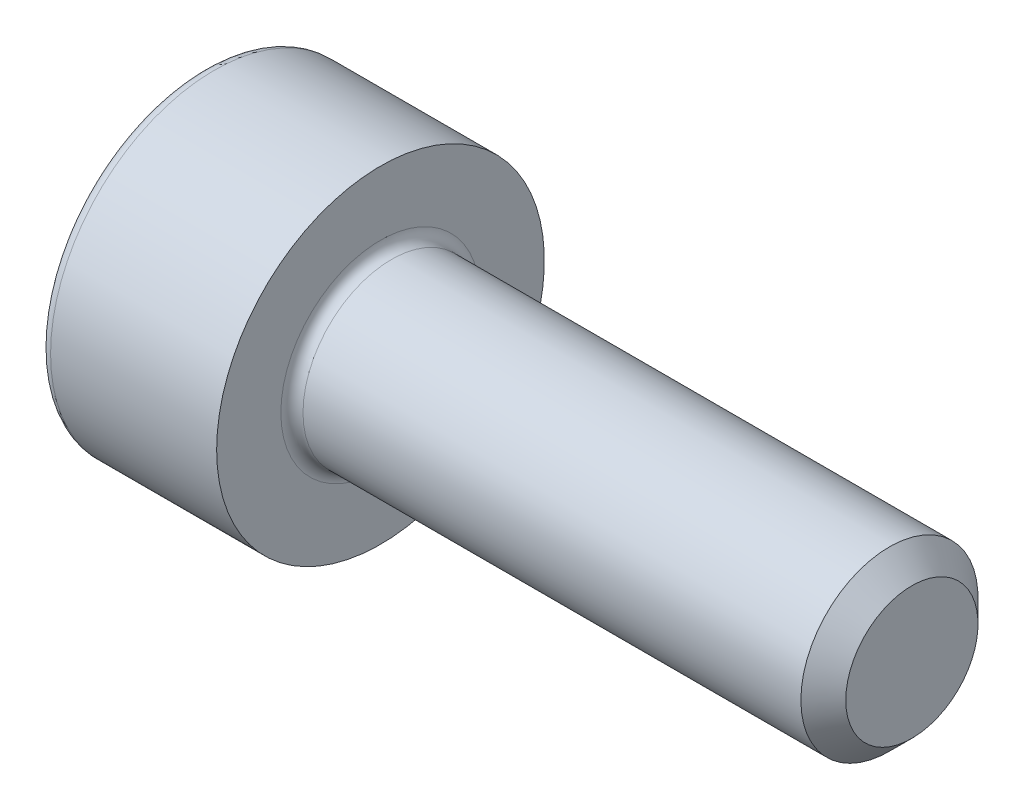
ISO-10303-21;
HEADER;
FILE_DESCRIPTION(('STEP AP214'),'2;1');
FILE_NAME('part.step','',(''),(''),'','','');
FILE_SCHEMA(('AUTOMOTIVE_DESIGN { 1 0 10303 214 1 1 1 1 }'));
ENDSEC;
DATA;
#1=APPLICATION_CONTEXT('core data for automotive mechanical design processes');
#2=APPLICATION_PROTOCOL_DEFINITION('international standard','automotive_design',2000,#1);
#3=PRODUCT_CONTEXT('',#1,'mechanical');
#4=PRODUCT('Part','Part','',(#3));
#5=PRODUCT_RELATED_PRODUCT_CATEGORY('part','',(#4));
#6=PRODUCT_DEFINITION_FORMATION('','',#4);
#7=PRODUCT_DEFINITION_CONTEXT('part definition',#1,'design');
#8=PRODUCT_DEFINITION('design','',#6,#7);
#9=PRODUCT_DEFINITION_SHAPE('','',#8);
#10=(LENGTH_UNIT() NAMED_UNIT(*) SI_UNIT(.MILLI.,.METRE.));
#11=(NAMED_UNIT(*) PLANE_ANGLE_UNIT() SI_UNIT($,.RADIAN.));
#12=(NAMED_UNIT(*) SI_UNIT($,.STERADIAN.) SOLID_ANGLE_UNIT());
#13=UNCERTAINTY_MEASURE_WITH_UNIT(LENGTH_MEASURE(1.E-05),#10,'distance_accuracy_value','');
#14=(GEOMETRIC_REPRESENTATION_CONTEXT(3) GLOBAL_UNCERTAINTY_ASSIGNED_CONTEXT((#13)) GLOBAL_UNIT_ASSIGNED_CONTEXT((#10,
#11,#12)) REPRESENTATION_CONTEXT('',''));
#15=CARTESIAN_POINT('',(0.,0.,0.));
#16=DIRECTION('',(0.,0.,1.));
#17=DIRECTION('',(1.,0.,0.));
#18=AXIS2_PLACEMENT_3D('',#15,#16,#17);
#19=CARTESIAN_POINT('',(6.,0.,0.));
#20=DIRECTION('',(-1.,0.,0.));
#21=DIRECTION('',(0.,0.,1.));
#22=AXIS2_PLACEMENT_3D('',#19,#20,#21);
#23=CONICAL_SURFACE('',#22,0.746499999993503,0.785398163397448);
#24=CARTESIAN_POINT('',(5.7464999999935,0.,0.));
#25=DIRECTION('',(-1.,0.,0.));
#26=DIRECTION('',(0.,0.,1.));
#27=AXIS2_PLACEMENT_3D('',#24,#25,#26);
#28=CIRCLE('',#27,1.);
#29=CARTESIAN_POINT('',(5.7464999999935,0.,1.));
#30=VERTEX_POINT('',#29);
#31=EDGE_CURVE('E11',#30,#30,#28,.T.);
#32=ORIENTED_EDGE('',*,*,#31,.F.);
#33=EDGE_LOOP('',(#32));
#34=FACE_BOUND('',#33,.T.);
#35=CARTESIAN_POINT('',(6.,0.,0.));
#36=DIRECTION('',(-1.,0.,0.));
#37=DIRECTION('',(0.,0.,1.));
#38=AXIS2_PLACEMENT_3D('',#35,#36,#37);
#39=CIRCLE('',#38,0.746499999993503);
#40=CARTESIAN_POINT('',(6.,0.,0.746499999993503));
#41=VERTEX_POINT('',#40);
#42=EDGE_CURVE('E134',#41,#41,#39,.T.);
#43=ORIENTED_EDGE('',*,*,#42,.T.);
#44=EDGE_LOOP('',(#43));
#45=FACE_BOUND('',#44,.T.);
#46=ADVANCED_FACE('F33',(#34,#45),#23,.T.);
#47=CARTESIAN_POINT('',(-2.,0.,0.));
#48=DIRECTION('',(-1.,0.,0.));
#49=DIRECTION('',(0.,0.,1.));
#50=AXIS2_PLACEMENT_3D('',#47,#48,#49);
#51=CYLINDRICAL_SURFACE('',#50,1.);
#52=CARTESIAN_POINT('',(0.125,0.,0.));
#53=DIRECTION('',(-1.,0.,0.));
#54=DIRECTION('',(0.,0.,1.));
#55=AXIS2_PLACEMENT_3D('',#52,#53,#54);
#56=CIRCLE('',#55,1.);
#57=CARTESIAN_POINT('',(0.125,0.,1.));
#58=VERTEX_POINT('',#57);
#59=EDGE_CURVE('E40',#58,#58,#56,.T.);
#60=ORIENTED_EDGE('',*,*,#59,.F.);
#61=EDGE_LOOP('',(#60));
#62=FACE_BOUND('',#61,.T.);
#63=ORIENTED_EDGE('',*,*,#31,.T.);
#64=EDGE_LOOP('',(#63));
#65=FACE_BOUND('',#64,.T.);
#66=ADVANCED_FACE('F158',(#62,#65),#51,.T.);
#67=CARTESIAN_POINT('',(0.125,0.,0.));
#68=DIRECTION('',(-1.,0.,0.));
#69=DIRECTION('',(0.,0.,1.));
#70=AXIS2_PLACEMENT_3D('',#67,#68,#69);
#71=TOROIDAL_SURFACE('',#70,1.125,0.125);
#72=CARTESIAN_POINT('',(0.,0.,0.));
#73=DIRECTION('',(-1.,0.,0.));
#74=DIRECTION('',(0.,0.,1.));
#75=AXIS2_PLACEMENT_3D('',#72,#73,#74);
#76=CIRCLE('',#75,1.125);
#77=CARTESIAN_POINT('',(0.,0.,1.125));
#78=VERTEX_POINT('',#77);
#79=EDGE_CURVE('E151',#78,#78,#76,.T.);
#80=ORIENTED_EDGE('',*,*,#79,.F.);
#81=EDGE_LOOP('',(#80));
#82=FACE_BOUND('',#81,.T.);
#83=ORIENTED_EDGE('',*,*,#59,.T.);
#84=EDGE_LOOP('',(#83));
#85=FACE_BOUND('',#84,.T.);
#86=ADVANCED_FACE('F156',(#82,#85),#71,.F.);
#87=CARTESIAN_POINT('',(0.,1.125,0.));
#88=DIRECTION('',(-1.,0.,0.));
#89=DIRECTION('',(0.,0.,1.));
#90=AXIS2_PLACEMENT_3D('',#87,#88,#89);
#91=PLANE('',#90);
#92=CARTESIAN_POINT('',(0.,0.,0.));
#93=DIRECTION('',(-1.,0.,0.));
#94=DIRECTION('',(0.,0.,1.));
#95=AXIS2_PLACEMENT_3D('',#92,#93,#94);
#96=CIRCLE('',#95,1.85);
#97=CARTESIAN_POINT('',(0.,0.,1.85));
#98=VERTEX_POINT('',#97);
#99=EDGE_CURVE('E148',#98,#98,#96,.T.);
#100=ORIENTED_EDGE('',*,*,#99,.F.);
#101=EDGE_LOOP('',(#100));
#102=FACE_BOUND('',#101,.T.);
#103=ORIENTED_EDGE('',*,*,#79,.T.);
#104=EDGE_LOOP('',(#103));
#105=FACE_BOUND('',#104,.T.);
#106=ADVANCED_FACE('F189',(#102,#105),#91,.F.);
#107=CARTESIAN_POINT('',(-2.,0.,0.));
#108=DIRECTION('',(-1.,0.,0.));
#109=DIRECTION('',(0.,0.,1.));
#110=AXIS2_PLACEMENT_3D('',#107,#108,#109);
#111=CYLINDRICAL_SURFACE('',#110,1.85);
#112=CARTESIAN_POINT('',(-1.875,0.,0.));
#113=DIRECTION('',(-1.,0.,0.));
#114=DIRECTION('',(0.,0.,1.));
#115=AXIS2_PLACEMENT_3D('',#112,#113,#114);
#116=CIRCLE('',#115,1.85);
#117=CARTESIAN_POINT('',(-1.875,0.,1.85));
#118=VERTEX_POINT('',#117);
#119=EDGE_CURVE('E145',#118,#118,#116,.T.);
#120=ORIENTED_EDGE('',*,*,#119,.F.);
#121=EDGE_LOOP('',(#120));
#122=FACE_BOUND('',#121,.T.);
#123=ORIENTED_EDGE('',*,*,#99,.T.);
#124=EDGE_LOOP('',(#123));
#125=FACE_BOUND('',#124,.T.);
#126=ADVANCED_FACE('F185',(#122,#125),#111,.T.);
#127=CARTESIAN_POINT('',(-1.875,0.,0.));
#128=DIRECTION('',(-1.,0.,0.));
#129=DIRECTION('',(0.,0.,1.));
#130=AXIS2_PLACEMENT_3D('',#127,#128,#129);
#131=TOROIDAL_SURFACE('',#130,1.725,0.125);
#132=CARTESIAN_POINT('',(-2.,0.,0.));
#133=DIRECTION('',(-1.,0.,0.));
#134=DIRECTION('',(0.,0.,1.));
#135=AXIS2_PLACEMENT_3D('',#132,#133,#134);
#136=CIRCLE('',#135,1.725);
#137=CARTESIAN_POINT('',(-2.,0.,1.725));
#138=VERTEX_POINT('',#137);
#139=EDGE_CURVE('E142',#138,#138,#136,.T.);
#140=ORIENTED_EDGE('',*,*,#139,.F.);
#141=EDGE_LOOP('',(#140));
#142=FACE_BOUND('',#141,.T.);
#143=ORIENTED_EDGE('',*,*,#119,.T.);
#144=EDGE_LOOP('',(#143));
#145=FACE_BOUND('',#144,.T.);
#146=ADVANCED_FACE('F178',(#142,#145),#131,.T.);
#147=CARTESIAN_POINT('',(-2.,1.725,0.));
#148=DIRECTION('',(1.,0.,0.));
#149=DIRECTION('',(0.,0.,-1.));
#150=AXIS2_PLACEMENT_3D('',#147,#148,#149);
#151=PLANE('',#150);
#152=DIRECTION('',(0.,0.5,-0.866025403784438));
#153=VECTOR('',#152,1.);
#154=CARTESIAN_POINT('',(-2.,0.433012701892219,0.75));
#155=LINE('',#154,#153);
#156=CARTESIAN_POINT('',(-2.,0.433012701892219,0.75));
#157=VERTEX_POINT('',#156);
#158=CARTESIAN_POINT('',(-2.,0.866025403784439,0.));
#159=VERTEX_POINT('',#158);
#160=EDGE_CURVE('E121',#157,#159,#155,.T.);
#161=ORIENTED_EDGE('',*,*,#160,.F.);
#162=DIRECTION('',(0.,1.,0.));
#163=VECTOR('',#162,1.);
#164=CARTESIAN_POINT('',(-2.,-0.43301270189222,0.75));
#165=LINE('',#164,#163);
#166=CARTESIAN_POINT('',(-2.,-0.43301270189222,0.75));
#167=VERTEX_POINT('',#166);
#168=EDGE_CURVE('E47',#167,#157,#165,.T.);
#169=ORIENTED_EDGE('',*,*,#168,.F.);
#170=DIRECTION('',(0.,0.5,0.866025403784439));
#171=VECTOR('',#170,1.);
#172=CARTESIAN_POINT('',(-2.,-0.866025403784439,0.));
#173=LINE('',#172,#171);
#174=CARTESIAN_POINT('',(-2.,-0.866025403784439,0.));
#175=VERTEX_POINT('',#174);
#176=EDGE_CURVE('E130',#175,#167,#173,.T.);
#177=ORIENTED_EDGE('',*,*,#176,.F.);
#178=DIRECTION('',(0.,-0.5,0.866025403784439));
#179=VECTOR('',#178,1.);
#180=CARTESIAN_POINT('',(-2.,-0.433012701892219,-0.75));
#181=LINE('',#180,#179);
#182=CARTESIAN_POINT('',(-2.,-0.433012701892219,-0.75));
#183=VERTEX_POINT('',#182);
#184=EDGE_CURVE('E128',#183,#175,#181,.T.);
#185=ORIENTED_EDGE('',*,*,#184,.F.);
#186=DIRECTION('',(0.,-1.,0.));
#187=VECTOR('',#186,1.);
#188=CARTESIAN_POINT('',(-2.,0.43301270189222,-0.75));
#189=LINE('',#188,#187);
#190=CARTESIAN_POINT('',(-2.,0.43301270189222,-0.75));
#191=VERTEX_POINT('',#190);
#192=EDGE_CURVE('E95',#191,#183,#189,.T.);
#193=ORIENTED_EDGE('',*,*,#192,.F.);
#194=DIRECTION('',(0.,-0.5,-0.866025403784439));
#195=VECTOR('',#194,1.);
#196=CARTESIAN_POINT('',(-2.,0.866025403784439,0.));
#197=LINE('',#196,#195);
#198=EDGE_CURVE('E124',#159,#191,#197,.T.);
#199=ORIENTED_EDGE('',*,*,#198,.F.);
#200=EDGE_LOOP('',(#161,#169,#177,#185,#193,#199));
#201=FACE_BOUND('',#200,.T.);
#202=ORIENTED_EDGE('',*,*,#139,.T.);
#203=EDGE_LOOP('',(#202));
#204=FACE_BOUND('',#203,.T.);
#205=ADVANCED_FACE('F170',(#201,#204),#151,.F.);
#206=CARTESIAN_POINT('',(6.,0.746499999993503,0.));
#207=DIRECTION('',(-1.,0.,0.));
#208=DIRECTION('',(0.,0.,1.));
#209=AXIS2_PLACEMENT_3D('',#206,#207,#208);
#210=PLANE('',#209);
#211=ORIENTED_EDGE('',*,*,#42,.F.);
#212=EDGE_LOOP('',(#211));
#213=FACE_BOUND('',#212,.T.);
#214=ADVANCED_FACE('F167',(#213),#210,.F.);
#215=CARTESIAN_POINT('',(-0.9,-0.43301270189222,0.75));
#216=DIRECTION('',(0.,0.,1.));
#217=DIRECTION('',(1.,0.,0.));
#218=AXIS2_PLACEMENT_3D('',#215,#216,#217);
#219=PLANE('',#218);
#220=ORIENTED_EDGE('',*,*,#168,.T.);
#221=DIRECTION('',(-1.,0.,0.));
#222=VECTOR('',#221,1.);
#223=CARTESIAN_POINT('',(-0.9,0.433012701892219,0.75));
#224=LINE('',#223,#222);
#225=CARTESIAN_POINT('',(-0.9,0.433012701892219,0.75));
#226=VERTEX_POINT('',#225);
#227=EDGE_CURVE('E77',#226,#157,#224,.T.);
#228=ORIENTED_EDGE('',*,*,#227,.F.);
#229=DIRECTION('',(0.,1.,0.));
#230=VECTOR('',#229,1.);
#231=CARTESIAN_POINT('',(-0.9,-0.43301270189222,0.75));
#232=LINE('',#231,#230);
#233=CARTESIAN_POINT('',(-0.9,-0.43301270189222,0.75));
#234=VERTEX_POINT('',#233);
#235=EDGE_CURVE('E132',#234,#226,#232,.T.);
#236=ORIENTED_EDGE('',*,*,#235,.F.);
#237=DIRECTION('',(-1.,0.,0.));
#238=VECTOR('',#237,1.);
#239=CARTESIAN_POINT('',(-0.9,-0.43301270189222,0.75));
#240=LINE('',#239,#238);
#241=EDGE_CURVE('E55',#234,#167,#240,.T.);
#242=ORIENTED_EDGE('',*,*,#241,.T.);
#243=EDGE_LOOP('',(#220,#228,#236,#242));
#244=FACE_BOUND('',#243,.T.);
#245=ADVANCED_FACE('F169',(#244),#219,.F.);
#246=CARTESIAN_POINT('',(-0.9,-0.866025403784439,0.));
#247=DIRECTION('',(0.,-0.866025403784439,0.5));
#248=DIRECTION('',(0.,-0.5,-0.866025403784439));
#249=AXIS2_PLACEMENT_3D('',#246,#247,#248);
#250=PLANE('',#249);
#251=ORIENTED_EDGE('',*,*,#176,.T.);
#252=ORIENTED_EDGE('',*,*,#241,.F.);
#253=DIRECTION('',(0.,0.5,0.866025403784439));
#254=VECTOR('',#253,1.);
#255=CARTESIAN_POINT('',(-0.9,-0.866025403784439,0.));
#256=LINE('',#255,#254);
#257=CARTESIAN_POINT('',(-0.9,-0.866025403784439,0.));
#258=VERTEX_POINT('',#257);
#259=EDGE_CURVE('E107',#258,#234,#256,.T.);
#260=ORIENTED_EDGE('',*,*,#259,.F.);
#261=DIRECTION('',(-1.,0.,0.));
#262=VECTOR('',#261,1.);
#263=CARTESIAN_POINT('',(-0.9,-0.866025403784439,0.));
#264=LINE('',#263,#262);
#265=EDGE_CURVE('E99',#258,#175,#264,.T.);
#266=ORIENTED_EDGE('',*,*,#265,.T.);
#267=EDGE_LOOP('',(#251,#252,#260,#266));
#268=FACE_BOUND('',#267,.T.);
#269=ADVANCED_FACE('F176',(#268),#250,.F.);
#270=CARTESIAN_POINT('',(-0.9,-0.433012701892219,-0.75));
#271=DIRECTION('',(0.,-0.866025403784439,-0.5));
#272=DIRECTION('',(0.,0.5,-0.866025403784439));
#273=AXIS2_PLACEMENT_3D('',#270,#271,#272);
#274=PLANE('',#273);
#275=ORIENTED_EDGE('',*,*,#184,.T.);
#276=ORIENTED_EDGE('',*,*,#265,.F.);
#277=DIRECTION('',(0.,-0.5,0.866025403784439));
#278=VECTOR('',#277,1.);
#279=CARTESIAN_POINT('',(-0.9,-0.433012701892219,-0.75));
#280=LINE('',#279,#278);
#281=CARTESIAN_POINT('',(-0.9,-0.433012701892219,-0.75));
#282=VERTEX_POINT('',#281);
#283=EDGE_CURVE('E103',#282,#258,#280,.T.);
#284=ORIENTED_EDGE('',*,*,#283,.F.);
#285=DIRECTION('',(-1.,0.,0.));
#286=VECTOR('',#285,1.);
#287=CARTESIAN_POINT('',(-0.9,-0.433012701892219,-0.75));
#288=LINE('',#287,#286);
#289=EDGE_CURVE('E88',#282,#183,#288,.T.);
#290=ORIENTED_EDGE('',*,*,#289,.T.);
#291=EDGE_LOOP('',(#275,#276,#284,#290));
#292=FACE_BOUND('',#291,.T.);
#293=ADVANCED_FACE('F104',(#292),#274,.F.);
#294=CARTESIAN_POINT('',(-0.9,0.43301270189222,-0.75));
#295=DIRECTION('',(0.,0.,-1.));
#296=DIRECTION('',(0.,1.,0.));
#297=AXIS2_PLACEMENT_3D('',#294,#295,#296);
#298=PLANE('',#297);
#299=ORIENTED_EDGE('',*,*,#192,.T.);
#300=ORIENTED_EDGE('',*,*,#289,.F.);
#301=DIRECTION('',(0.,-1.,0.));
#302=VECTOR('',#301,1.);
#303=CARTESIAN_POINT('',(-0.9,0.43301270189222,-0.75));
#304=LINE('',#303,#302);
#305=CARTESIAN_POINT('',(-0.9,0.43301270189222,-0.75));
#306=VERTEX_POINT('',#305);
#307=EDGE_CURVE('E92',#306,#282,#304,.T.);
#308=ORIENTED_EDGE('',*,*,#307,.F.);
#309=DIRECTION('',(-1.,0.,0.));
#310=VECTOR('',#309,1.);
#311=CARTESIAN_POINT('',(-0.9,0.43301270189222,-0.75));
#312=LINE('',#311,#310);
#313=EDGE_CURVE('E100',#306,#191,#312,.T.);
#314=ORIENTED_EDGE('',*,*,#313,.T.);
#315=EDGE_LOOP('',(#299,#300,#308,#314));
#316=FACE_BOUND('',#315,.T.);
#317=ADVANCED_FACE('F90',(#316),#298,.F.);
#318=CARTESIAN_POINT('',(-0.9,0.866025403784439,0.));
#319=DIRECTION('',(0.,0.866025403784439,-0.5));
#320=DIRECTION('',(0.,0.5,0.866025403784439));
#321=AXIS2_PLACEMENT_3D('',#318,#319,#320);
#322=PLANE('',#321);
#323=ORIENTED_EDGE('',*,*,#198,.T.);
#324=ORIENTED_EDGE('',*,*,#313,.F.);
#325=DIRECTION('',(0.,-0.5,-0.866025403784439));
#326=VECTOR('',#325,1.);
#327=CARTESIAN_POINT('',(-0.9,0.866025403784439,0.));
#328=LINE('',#327,#326);
#329=CARTESIAN_POINT('',(-0.9,0.866025403784439,0.));
#330=VERTEX_POINT('',#329);
#331=EDGE_CURVE('E113',#330,#306,#328,.T.);
#332=ORIENTED_EDGE('',*,*,#331,.F.);
#333=DIRECTION('',(-1.,0.,0.));
#334=VECTOR('',#333,1.);
#335=CARTESIAN_POINT('',(-0.9,0.866025403784439,0.));
#336=LINE('',#335,#334);
#337=EDGE_CURVE('E137',#330,#159,#336,.T.);
#338=ORIENTED_EDGE('',*,*,#337,.T.);
#339=EDGE_LOOP('',(#323,#324,#332,#338));
#340=FACE_BOUND('',#339,.T.);
#341=ADVANCED_FACE('F251',(#340),#322,.F.);
#342=CARTESIAN_POINT('',(-0.9,0.433012701892219,0.75));
#343=DIRECTION('',(0.,0.866025403784439,0.5));
#344=DIRECTION('',(0.,-0.5,0.866025403784438));
#345=AXIS2_PLACEMENT_3D('',#342,#343,#344);
#346=PLANE('',#345);
#347=ORIENTED_EDGE('',*,*,#160,.T.);
#348=ORIENTED_EDGE('',*,*,#337,.F.);
#349=DIRECTION('',(0.,0.5,-0.866025403784438));
#350=VECTOR('',#349,1.);
#351=CARTESIAN_POINT('',(-0.9,0.433012701892219,0.75));
#352=LINE('',#351,#350);
#353=EDGE_CURVE('E115',#226,#330,#352,.T.);
#354=ORIENTED_EDGE('',*,*,#353,.F.);
#355=ORIENTED_EDGE('',*,*,#227,.T.);
#356=EDGE_LOOP('',(#347,#348,#354,#355));
#357=FACE_BOUND('',#356,.T.);
#358=ADVANCED_FACE('F260',(#357),#346,.F.);
#359=CARTESIAN_POINT('',(-0.9,0.,0.));
#360=DIRECTION('',(-1.,0.,0.));
#361=DIRECTION('',(0.,0.,1.));
#362=AXIS2_PLACEMENT_3D('',#359,#360,#361);
#363=PLANE('',#362);
#364=ORIENTED_EDGE('',*,*,#235,.T.);
#365=ORIENTED_EDGE('',*,*,#353,.T.);
#366=ORIENTED_EDGE('',*,*,#331,.T.);
#367=ORIENTED_EDGE('',*,*,#307,.T.);
#368=ORIENTED_EDGE('',*,*,#283,.T.);
#369=ORIENTED_EDGE('',*,*,#259,.T.);
#370=EDGE_LOOP('',(#364,#365,#366,#367,#368,#369));
#371=FACE_BOUND('',#370,.T.);
#372=ADVANCED_FACE('F110',(#371),#363,.T.);
#373=CLOSED_SHELL('',(#46,#66,#86,#106,#126,#146,#205,#214,#245,#269,#293,#317,#341,#358,#372));
#374=MANIFOLD_SOLID_BREP('B2',#373);
#375=ADVANCED_BREP_SHAPE_REPRESENTATION('',(#18,#374),#14);
#376=SHAPE_DEFINITION_REPRESENTATION(#9,#375);
ENDSEC;
END-ISO-10303-21;
